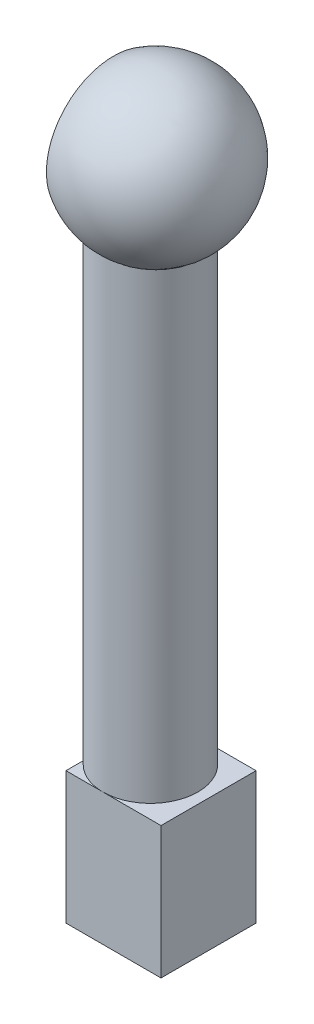
ISO-10303-21;
HEADER;
FILE_DESCRIPTION(('STEP AP214'),'2;1');
FILE_NAME('part.step','',(''),(''),'','','');
FILE_SCHEMA(('AUTOMOTIVE_DESIGN { 1 0 10303 214 1 1 1 1 }'));
ENDSEC;
DATA;
#1=APPLICATION_CONTEXT('core data for automotive mechanical design processes');
#2=APPLICATION_PROTOCOL_DEFINITION('international standard','automotive_design',2000,#1);
#3=PRODUCT_CONTEXT('',#1,'mechanical');
#4=PRODUCT('Part','Part','',(#3));
#5=PRODUCT_RELATED_PRODUCT_CATEGORY('part','',(#4));
#6=PRODUCT_DEFINITION_FORMATION('','',#4);
#7=PRODUCT_DEFINITION_CONTEXT('part definition',#1,'design');
#8=PRODUCT_DEFINITION('design','',#6,#7);
#9=PRODUCT_DEFINITION_SHAPE('','',#8);
#10=(LENGTH_UNIT() NAMED_UNIT(*) SI_UNIT(.MILLI.,.METRE.));
#11=(NAMED_UNIT(*) PLANE_ANGLE_UNIT() SI_UNIT($,.RADIAN.));
#12=(NAMED_UNIT(*) SI_UNIT($,.STERADIAN.) SOLID_ANGLE_UNIT());
#13=UNCERTAINTY_MEASURE_WITH_UNIT(LENGTH_MEASURE(1.E-05),#10,'distance_accuracy_value','');
#14=(GEOMETRIC_REPRESENTATION_CONTEXT(3) GLOBAL_UNCERTAINTY_ASSIGNED_CONTEXT((#13)) GLOBAL_UNIT_ASSIGNED_CONTEXT((#10,
#11,#12)) REPRESENTATION_CONTEXT('',''));
#15=CARTESIAN_POINT('',(0.,0.,0.));
#16=DIRECTION('',(0.,0.,1.));
#17=DIRECTION('',(1.,0.,0.));
#18=AXIS2_PLACEMENT_3D('',#15,#16,#17);
#19=CARTESIAN_POINT('',(8.,112.5,0.));
#20=DIRECTION('',(0.,0.,-1.));
#21=DIRECTION('',(1.,0.,0.));
#22=AXIS2_PLACEMENT_3D('',#19,#20,#21);
#23=SPHERICAL_SURFACE('',#22,15.);
#24=CARTESIAN_POINT('',(-0.0002,101.142200917431,-5.65660675316924));
#25=CARTESIAN_POINT('',(0.159226429552618,101.12816404405,-5.85394456270704));
#26=CARTESIAN_POINT('',(0.327009064397159,101.113417723746,-6.0444719838419));
#27=CARTESIAN_POINT('',(0.677977454781112,101.082636429866,-6.41063237746506));
#28=CARTESIAN_POINT('',(0.861162190433337,101.066601541619,-6.58626633461546));
#29=CARTESIAN_POINT('',(1.24149235089014,101.033384961327,-6.92125642203254));
#30=CARTESIAN_POINT('',(1.43862631093757,101.016204211709,-7.08062566294762));
#31=CARTESIAN_POINT('',(1.84556686784812,100.980822660256,-7.38213631983255));
#32=CARTESIAN_POINT('',(2.05537337482632,100.962621865656,-7.52427785797501));
#33=CARTESIAN_POINT('',(2.48624376051173,100.92533649927,-7.7903881062603));
#34=CARTESIAN_POINT('',(2.70731176733069,100.906251603636,-7.91435008681562));
#35=CARTESIAN_POINT('',(3.1590632082289,100.867351777167,-8.14317599791478));
#36=CARTESIAN_POINT('',(3.38974681279554,100.84753683339,-8.24803958966141));
#37=CARTESIAN_POINT('',(3.85905016057209,100.807331170978,-8.43792030765256));
#38=CARTESIAN_POINT('',(4.09766862461698,100.786940545227,-8.52294061524826));
#39=CARTESIAN_POINT('',(4.58118596544015,100.745732841768,-8.67256494656186));
#40=CARTESIAN_POINT('',(4.82608482674891,100.724915765111,-8.73716902056269));
#41=CARTESIAN_POINT('',(5.3209412507796,100.682964696537,-8.84562348299345));
#42=CARTESIAN_POINT('',(5.57090818690204,100.661830140587,-8.88943088760492));
#43=CARTESIAN_POINT('',(6.0737246805863,100.619431877091,-8.95579944654537));
#44=CARTESIAN_POINT('',(6.32657520735289,100.598168127315,-8.97835323074184));
#45=CARTESIAN_POINT('',(6.83327231077784,100.555670963762,-9.00202896228383));
#46=CARTESIAN_POINT('',(7.0871188562154,100.534437549063,-9.00315157611855));
#47=CARTESIAN_POINT('',(7.5940189555199,100.492149025707,-8.98395634265039));
#48=CARTESIAN_POINT('',(7.84707249690605,100.471093919847,-8.96363815958206));
#49=CARTESIAN_POINT('',(8.35086123291072,100.429285026704,-8.90166585114058));
#50=CARTESIAN_POINT('',(8.60159359644402,100.40853159329,-8.85998846825485));
#51=CARTESIAN_POINT('',(9.09867898244304,100.367490815964,-8.75557234717104));
#52=CARTESIAN_POINT('',(9.34503190377218,100.347203482813,-8.69283312324522));
#53=CARTESIAN_POINT('',(9.83153483959631,100.307237025291,-8.54674798405963));
#54=CARTESIAN_POINT('',(10.0716863601095,100.287557753019,-8.46340712491511));
#55=CARTESIAN_POINT('',(10.5442145427364,100.248926481342,-8.27666023609827));
#56=CARTESIAN_POINT('',(10.7765884882351,100.229974735719,-8.17324727948803));
#57=CARTESIAN_POINT('',(11.2315173493628,100.192954174527,-7.94724405913697));
#58=CARTESIAN_POINT('',(11.4540844114928,100.174884263578,-7.82467842508971));
#59=CARTESIAN_POINT('',(11.888122278083,100.139718701566,-7.56113238127527));
#60=CARTESIAN_POINT('',(12.0995928779538,100.122623068466,-7.42015163214914));
#61=CARTESIAN_POINT('',(12.509910058203,100.089516762802,-7.12077156576664));
#62=CARTESIAN_POINT('',(12.7087567562104,100.073506080128,-6.96237241085207));
#63=CARTESIAN_POINT('',(13.0923974635182,100.042671526991,-6.62927057600549));
#64=CARTESIAN_POINT('',(13.2771911909844,100.02784768033,-6.45456756925404));
#65=CARTESIAN_POINT('',(13.6308988809827,99.9995200937908,-6.09059927601648));
#66=CARTESIAN_POINT('',(13.7998548966575,99.9860128539503,-5.90137512865447));
#67=CARTESIAN_POINT('',(14.1212348580881,99.9603574882847,-5.50928918330946));
#68=CARTESIAN_POINT('',(14.2736589523678,99.9482093502492,-5.30642750787333));
#69=CARTESIAN_POINT('',(14.5608704315419,99.9253480536402,-4.88850937069203));
#70=CARTESIAN_POINT('',(14.6956580921405,99.9146348726345,-4.67345309965594));
#71=CARTESIAN_POINT('',(14.9466207054768,99.8947098125159,-4.23267479172378));
#72=CARTESIAN_POINT('',(15.0627956729911,99.8854979322112,-4.00695276329535));
#73=CARTESIAN_POINT('',(15.2753356971084,99.8686603214552,-3.54721588924438));
#74=CARTESIAN_POINT('',(15.371764841877,99.8610294585804,-3.31323085806842));
#75=CARTESIAN_POINT('',(15.5446241305187,99.8473601558783,-2.83784905866247));
#76=CARTESIAN_POINT('',(15.6210473413017,99.8413222680936,-2.59644975329977));
#77=CARTESIAN_POINT('',(15.7532826186728,99.8308803574823,-2.10808619026538));
#78=CARTESIAN_POINT('',(15.8090986878065,99.8264760173694,-1.86112302316581));
#79=CARTESIAN_POINT('',(15.899735495069,99.8193263668107,-1.36334466676926));
#80=CARTESIAN_POINT('',(15.9345558298835,99.8165810882344,-1.11252940357096));
#81=CARTESIAN_POINT('',(15.9828898202327,99.812770859332,-0.609429282946981));
#82=CARTESIAN_POINT('',(15.996452709601,99.8117020262285,-0.357149183692108));
#83=CARTESIAN_POINT('',(16.0023282586629,99.8112389661835,0.147664920609639));
#84=CARTESIAN_POINT('',(15.9946405096387,99.8118447714505,0.400198930446644));
#85=CARTESIAN_POINT('',(15.9580699230292,99.8147273613757,0.903713689628644));
#86=CARTESIAN_POINT('',(15.9291874336374,99.817004118583,1.15469446442233));
#87=CARTESIAN_POINT('',(15.8504371102387,99.8232147667346,1.65332104101938));
#88=CARTESIAN_POINT('',(15.8005692711634,99.827148658079,1.90096684201725));
#89=CARTESIAN_POINT('',(15.6802462053351,99.8366467740298,2.39101292263306));
#90=CARTESIAN_POINT('',(15.6098035601239,99.8422100022984,2.63341631099039));
#91=CARTESIAN_POINT('',(15.4488299409077,99.8549337556553,3.11140945464511));
#92=CARTESIAN_POINT('',(15.3582993981669,99.8620942464521,3.34699935609757));
#93=CARTESIAN_POINT('',(15.1577999255626,99.8779691484232,3.80970820595454));
#94=CARTESIAN_POINT('',(15.0478305950062,99.8866835916293,4.03682697962626));
#95=CARTESIAN_POINT('',(14.8092485982939,99.9056128877549,4.4809802180876));
#96=CARTESIAN_POINT('',(14.6806362785026,99.9158277127992,4.69801487012933));
#97=CARTESIAN_POINT('',(14.4054899631766,99.9377112048372,5.12078318024648));
#98=CARTESIAN_POINT('',(14.2589301795073,99.9493819642774,5.32649994653511));
#99=CARTESIAN_POINT('',(13.9491431703661,99.9740893005933,5.72477381226249));
#100=CARTESIAN_POINT('',(13.7859216705664,99.9871254083172,5.91733539466292));
#101=CARTESIAN_POINT('',(13.4439040104057,100.014488589305,6.28806146301864));
#102=CARTESIAN_POINT('',(13.2651048140104,100.028815914241,6.46622312938294));
#103=CARTESIAN_POINT('',(12.8932392067962,100.058669638506,6.80685754812857));
#104=CARTESIAN_POINT('',(12.7001730806442,100.07419601391,6.96933061339431));
#105=CARTESIAN_POINT('',(12.3005993674836,100.10639444851,7.27787985095317));
#106=CARTESIAN_POINT('',(12.094056568007,100.123069515953,7.4239101099663));
#107=CARTESIAN_POINT('',(11.669479349465,100.157421110274,7.69803971101369));
#108=CARTESIAN_POINT('',(11.4514450702628,100.175097624963,7.82613927121363));
#109=CARTESIAN_POINT('',(11.0053916296167,100.211342153088,8.06354017909889));
#110=CARTESIAN_POINT('',(10.7773706450926,100.229910329358,8.17283807643098));
#111=CARTESIAN_POINT('',(10.3130781407714,100.267808243242,8.37181471600377));
#112=CARTESIAN_POINT('',(10.0768094673437,100.287137718412,8.46150015059876));
#113=CARTESIAN_POINT('',(9.59682281859466,100.326502792159,8.62094397727154));
#114=CARTESIAN_POINT('',(9.35308274635448,100.34654051901,8.69063532949219));
#115=CARTESIAN_POINT('',(8.86063993222967,100.387127028068,8.8092087037556));
#116=CARTESIAN_POINT('',(8.61193728974007,100.407675800042,8.85809114214176));
#117=CARTESIAN_POINT('',(8.11131843330367,100.449146635848,8.93471297263942));
#118=CARTESIAN_POINT('',(7.85940211297583,100.470068712047,8.96245166298204));
#119=CARTESIAN_POINT('',(7.35415069904265,100.512141813107,8.99659312153944));
#120=CARTESIAN_POINT('',(7.10081562527573,100.53329283477,9.00299618734762));
#121=CARTESIAN_POINT('',(6.59390112987572,100.575728386136,8.99441480740389));
#122=CARTESIAN_POINT('',(6.34032260006244,100.597013115044,8.97937857706341));
#123=CARTESIAN_POINT('',(5.83542444803432,100.639506748483,8.92794118818703));
#124=CARTESIAN_POINT('',(5.58410407815538,100.660715676596,8.89154738719422));
#125=CARTESIAN_POINT('',(5.08534612539792,100.702918257009,8.79764247719859));
#126=CARTESIAN_POINT('',(4.8379096772432,100.723911845795,8.74012531229197));
#127=CARTESIAN_POINT('',(4.34875754326556,100.765523106054,8.60437893412233));
#128=CARTESIAN_POINT('',(4.10704175189491,100.78614078446,8.52615010332048));
#129=CARTESIAN_POINT('',(3.63087696880259,100.826861227704,8.34946360648111));
#130=CARTESIAN_POINT('',(3.39643328249119,100.846963614834,8.25099155361384));
#131=CARTESIAN_POINT('',(2.93667340639718,100.88648471188,8.03454641588384));
#132=CARTESIAN_POINT('',(2.71135707862559,100.90590343213,7.91657362597372));
#133=CARTESIAN_POINT('',(2.27158457975327,100.94389642546,7.66202255265097));
#134=CARTESIAN_POINT('',(2.05712218978345,100.962471181458,7.5254550926388));
#135=CARTESIAN_POINT('',(1.64053864494382,100.998634675315,7.23468744441583));
#136=CARTESIAN_POINT('',(1.43841385488319,101.016223703486,7.0804924888729));
#137=CARTESIAN_POINT('',(1.01574599918162,101.053084044418,6.72875430177732));
#138=CARTESIAN_POINT('',(0.797629081611496,101.072157289855,6.52825075580277));
#139=CARTESIAN_POINT('',(0.486251415125274,101.099448010343,6.21232138761675));
#140=CARTESIAN_POINT('',(0.385154428968884,101.108319541866,6.10456005870645));
#141=CARTESIAN_POINT('',(0.188369931199796,101.125607071583,5.88417431541953));
#142=CARTESIAN_POINT('',(0.0926823429799898,101.134023076227,5.77154996995211));
#143=CARTESIAN_POINT('',(-0.0001999999999992,101.142200917431,5.65660675316926));
#144=B_SPLINE_CURVE_WITH_KNOTS('',3,(#24,#25,#26,#27,#28,#29,#30,#31,#32,#33,#34,#35,#36,#37,
#38,#39,#40,#41,#42,#43,#44,#45,#46,#47,#48,#49,#50,#51,#52,#53,#54,#55,#56,#57,#58,#59,#60,#61,
#62,#63,#64,#65,#66,#67,#68,#69,#70,#71,#72,#73,#74,#75,#76,#77,#78,#79,#80,#81,#82,#83,#84,#85,
#86,#87,#88,#89,#90,#91,#92,#93,#94,#95,#96,#97,#98,#99,#100,#101,#102,#103,#104,#105,#106,#107,
#108,#109,#110,#111,#112,#113,#114,#115,#116,#117,#118,#119,#120,#121,#122,#123,#124,#125,#126,
#127,#128,#129,#130,#131,#132,#133,#134,#135,#136,#137,#138,#139,#140,#141,#142,#143),
.UNSPECIFIED.,.F.,.F.,(4,2,2,2,2,2,2,2,2,2,2,2,2,2,2,2,2,2,2,2,2,2,2,2,2,2,2,2,2,2,2,2,2,2,2,2,
2,2,2,2,2,2,2,2,2,2,2,2,2,2,2,2,2,2,2,2,2,2,2,4),(0.,0.761999554471396,1.52394869098601,
2.28527870285736,3.04660331533682,3.80820904236431,4.56982827863475,5.33132532519173,
6.09282049625144,6.85588279219463,7.61920959850648,8.38251266603559,9.14582768715937,
9.90997563496493,10.674141206745,11.4381194205871,12.2023617557646,12.9656292685623,
13.7289108490549,14.4921853162674,15.2554750870138,16.0166770403088,16.7778721543541,
17.5390553674874,18.3002379763212,19.0589094577888,19.8178435111096,20.5766300782689,
21.3354312207537,22.0924723122449,22.8495279641561,23.6065711792137,24.3636145771143,
25.1201960069686,25.8767611954538,26.6333419808848,27.3899087117443,28.147575573383,
28.9049829394966,29.6625382530883,30.4200784553116,31.1796840627851,31.9392804272126,
32.6990160392323,33.4584920009838,34.2204854826127,34.9824637176085,35.7444672418448,
36.5064601374646,37.27029667564,38.0338702314748,38.7976628690052,39.5614414033409,
40.3257646423508,41.0900763218742,41.8539450053249,42.617587522634,43.5066330870117,
43.9505598753058,44.3944803751974),.UNSPECIFIED.);
#145=CARTESIAN_POINT('',(0.,101.142183308399,-5.65685424949234));
#146=VERTEX_POINT('',#145);
#147=CARTESIAN_POINT('',(0.,101.142183308399,5.65685424949238));
#148=VERTEX_POINT('',#147);
#149=EDGE_CURVE('E47',#146,#148,#144,.T.);
#150=ORIENTED_EDGE('',*,*,#149,.F.);
#151=CARTESIAN_POINT('',(0.,112.5,0.));
#152=DIRECTION('',(-1.,0.,0.));
#153=DIRECTION('',(0.,0.,1.));
#154=AXIS2_PLACEMENT_3D('',#151,#152,#153);
#155=CIRCLE('',#154,12.6885775404495);
#156=EDGE_CURVE('E11',#146,#148,#155,.F.);
#157=ORIENTED_EDGE('',*,*,#156,.T.);
#158=EDGE_LOOP('',(#150,#157));
#159=FACE_BOUND('',#158,.T.);
#160=ADVANCED_FACE('F39',(#159),#23,.T.);
#161=CARTESIAN_POINT('',(18.,12.5,-9.));
#162=DIRECTION('',(0.,-1.,0.));
#163=DIRECTION('',(0.,0.,-1.));
#164=AXIS2_PLACEMENT_3D('',#161,#162,#163);
#165=PLANE('',#164);
#166=CARTESIAN_POINT('',(7.,12.5,0.));
#167=DIRECTION('',(0.,1.,0.));
#168=DIRECTION('',(0.,0.,1.));
#169=AXIS2_PLACEMENT_3D('',#166,#167,#168);
#170=CIRCLE('',#169,9.);
#171=CARTESIAN_POINT('',(0.,12.5,5.65685424949237));
#172=VERTEX_POINT('',#171);
#173=CARTESIAN_POINT('',(7.,12.5,9.));
#174=VERTEX_POINT('',#173);
#175=EDGE_CURVE('E134',#172,#174,#170,.T.);
#176=ORIENTED_EDGE('',*,*,#175,.F.);
#177=DIRECTION('',(0.,0.,1.));
#178=VECTOR('',#177,1.);
#179=CARTESIAN_POINT('',(0.,12.5,-9.));
#180=LINE('',#179,#178);
#181=CARTESIAN_POINT('',(0.,12.5,9.));
#182=VERTEX_POINT('',#181);
#183=EDGE_CURVE('E186',#172,#182,#180,.T.);
#184=ORIENTED_EDGE('',*,*,#183,.T.);
#185=DIRECTION('',(-1.,0.,0.));
#186=VECTOR('',#185,1.);
#187=CARTESIAN_POINT('',(18.,12.5,9.));
#188=LINE('',#187,#186);
#189=EDGE_CURVE('E178',#174,#182,#188,.T.);
#190=ORIENTED_EDGE('',*,*,#189,.F.);
#191=EDGE_LOOP('',(#176,#184,#190));
#192=FACE_BOUND('',#191,.T.);
#193=ADVANCED_FACE('F209',(#192),#165,.F.);
#194=CARTESIAN_POINT('',(7.,12.5,-9.));
#195=VERTEX_POINT('',#194);
#196=EDGE_CURVE('E127',#174,#195,#170,.T.);
#197=ORIENTED_EDGE('',*,*,#196,.F.);
#198=CARTESIAN_POINT('',(18.,12.5,9.));
#199=VERTEX_POINT('',#198);
#200=EDGE_CURVE('E188',#199,#174,#188,.T.);
#201=ORIENTED_EDGE('',*,*,#200,.F.);
#202=DIRECTION('',(0.,0.,1.));
#203=VECTOR('',#202,1.);
#204=CARTESIAN_POINT('',(18.,12.5,-9.));
#205=LINE('',#204,#203);
#206=CARTESIAN_POINT('',(18.,12.5,-9.));
#207=VERTEX_POINT('',#206);
#208=EDGE_CURVE('E176',#207,#199,#205,.T.);
#209=ORIENTED_EDGE('',*,*,#208,.F.);
#210=DIRECTION('',(-1.,0.,0.));
#211=VECTOR('',#210,1.);
#212=CARTESIAN_POINT('',(18.,12.5,-9.));
#213=LINE('',#212,#211);
#214=EDGE_CURVE('E192',#207,#195,#213,.T.);
#215=ORIENTED_EDGE('',*,*,#214,.T.);
#216=EDGE_LOOP('',(#197,#201,#209,#215));
#217=FACE_BOUND('',#216,.T.);
#218=ADVANCED_FACE('F215',(#217),#165,.F.);
#219=CARTESIAN_POINT('',(18.,-12.5,9.));
#220=DIRECTION('',(0.,0.,-1.));
#221=DIRECTION('',(-1.,0.,0.));
#222=AXIS2_PLACEMENT_3D('',#219,#220,#221);
#223=PLANE('',#222);
#224=DIRECTION('',(0.,-1.,0.));
#225=VECTOR('',#224,1.);
#226=CARTESIAN_POINT('',(0.,-12.5,9.));
#227=LINE('',#226,#225);
#228=CARTESIAN_POINT('',(0.,-12.5,9.));
#229=VERTEX_POINT('',#228);
#230=EDGE_CURVE('E161',#182,#229,#227,.T.);
#231=ORIENTED_EDGE('',*,*,#230,.T.);
#232=DIRECTION('',(-1.,0.,0.));
#233=VECTOR('',#232,1.);
#234=CARTESIAN_POINT('',(18.,-12.5,9.));
#235=LINE('',#234,#233);
#236=CARTESIAN_POINT('',(18.,-12.5,9.));
#237=VERTEX_POINT('',#236);
#238=EDGE_CURVE('E198',#237,#229,#235,.T.);
#239=ORIENTED_EDGE('',*,*,#238,.F.);
#240=DIRECTION('',(0.,-1.,0.));
#241=VECTOR('',#240,1.);
#242=CARTESIAN_POINT('',(18.,-12.5,9.));
#243=LINE('',#242,#241);
#244=EDGE_CURVE('E168',#199,#237,#243,.T.);
#245=ORIENTED_EDGE('',*,*,#244,.F.);
#246=ORIENTED_EDGE('',*,*,#200,.T.);
#247=ORIENTED_EDGE('',*,*,#189,.T.);
#248=EDGE_LOOP('',(#231,#239,#245,#246,#247));
#249=FACE_BOUND('',#248,.T.);
#250=ADVANCED_FACE('F41',(#249),#223,.F.);
#251=CARTESIAN_POINT('',(18.,-12.5,-9.));
#252=DIRECTION('',(0.,1.,0.));
#253=DIRECTION('',(0.,0.,1.));
#254=AXIS2_PLACEMENT_3D('',#251,#252,#253);
#255=PLANE('',#254);
#256=DIRECTION('',(-1.,0.,0.));
#257=VECTOR('',#256,1.);
#258=CARTESIAN_POINT('',(8.5,-12.5,6.2));
#259=LINE('',#258,#257);
#260=CARTESIAN_POINT('',(15.5,-12.5,6.2));
#261=VERTEX_POINT('',#260);
#262=CARTESIAN_POINT('',(8.5,-12.5,6.2));
#263=VERTEX_POINT('',#262);
#264=EDGE_CURVE('E132',#261,#263,#259,.T.);
#265=ORIENTED_EDGE('',*,*,#264,.F.);
#266=DIRECTION('',(0.,0.,1.));
#267=VECTOR('',#266,1.);
#268=CARTESIAN_POINT('',(15.5,-12.5,-6.2));
#269=LINE('',#268,#267);
#270=CARTESIAN_POINT('',(15.5,-12.5,-6.2));
#271=VERTEX_POINT('',#270);
#272=EDGE_CURVE('E130',#271,#261,#269,.T.);
#273=ORIENTED_EDGE('',*,*,#272,.F.);
#274=DIRECTION('',(1.,0.,0.));
#275=VECTOR('',#274,1.);
#276=CARTESIAN_POINT('',(8.5,-12.5,-6.2));
#277=LINE('',#276,#275);
#278=CARTESIAN_POINT('',(8.5,-12.5,-6.2));
#279=VERTEX_POINT('',#278);
#280=EDGE_CURVE('E142',#279,#271,#277,.T.);
#281=ORIENTED_EDGE('',*,*,#280,.F.);
#282=DIRECTION('',(0.,0.,-1.));
#283=VECTOR('',#282,1.);
#284=CARTESIAN_POINT('',(8.5,-12.5,-6.2));
#285=LINE('',#284,#283);
#286=EDGE_CURVE('E154',#263,#279,#285,.T.);
#287=ORIENTED_EDGE('',*,*,#286,.F.);
#288=EDGE_LOOP('',(#265,#273,#281,#287));
#289=FACE_BOUND('',#288,.T.);
#290=DIRECTION('',(0.,0.,-1.));
#291=VECTOR('',#290,1.);
#292=CARTESIAN_POINT('',(0.,-12.5,-9.));
#293=LINE('',#292,#291);
#294=CARTESIAN_POINT('',(0.,-12.5,-9.));
#295=VERTEX_POINT('',#294);
#296=EDGE_CURVE('E181',#229,#295,#293,.T.);
#297=ORIENTED_EDGE('',*,*,#296,.T.);
#298=DIRECTION('',(-1.,0.,0.));
#299=VECTOR('',#298,1.);
#300=CARTESIAN_POINT('',(18.,-12.5,-9.));
#301=LINE('',#300,#299);
#302=CARTESIAN_POINT('',(18.,-12.5,-9.));
#303=VERTEX_POINT('',#302);
#304=EDGE_CURVE('E195',#303,#295,#301,.T.);
#305=ORIENTED_EDGE('',*,*,#304,.F.);
#306=DIRECTION('',(0.,0.,-1.));
#307=VECTOR('',#306,1.);
#308=CARTESIAN_POINT('',(18.,-12.5,-9.));
#309=LINE('',#308,#307);
#310=EDGE_CURVE('E171',#237,#303,#309,.T.);
#311=ORIENTED_EDGE('',*,*,#310,.F.);
#312=ORIENTED_EDGE('',*,*,#238,.T.);
#313=EDGE_LOOP('',(#297,#305,#311,#312));
#314=FACE_BOUND('',#313,.T.);
#315=ADVANCED_FACE('F236',(#289,#314),#255,.F.);
#316=CARTESIAN_POINT('',(18.,-12.5,-9.));
#317=DIRECTION('',(0.,0.,1.));
#318=DIRECTION('',(1.,0.,0.));
#319=AXIS2_PLACEMENT_3D('',#316,#317,#318);
#320=PLANE('',#319);
#321=DIRECTION('',(0.,1.,0.));
#322=VECTOR('',#321,1.);
#323=CARTESIAN_POINT('',(0.,-12.5,-9.));
#324=LINE('',#323,#322);
#325=CARTESIAN_POINT('',(0.,12.5,-9.));
#326=VERTEX_POINT('',#325);
#327=EDGE_CURVE('E183',#295,#326,#324,.T.);
#328=ORIENTED_EDGE('',*,*,#327,.T.);
#329=EDGE_CURVE('E191',#195,#326,#213,.T.);
#330=ORIENTED_EDGE('',*,*,#329,.F.);
#331=ORIENTED_EDGE('',*,*,#214,.F.);
#332=DIRECTION('',(0.,1.,0.));
#333=VECTOR('',#332,1.);
#334=CARTESIAN_POINT('',(18.,-12.5,-9.));
#335=LINE('',#334,#333);
#336=EDGE_CURVE('E174',#303,#207,#335,.T.);
#337=ORIENTED_EDGE('',*,*,#336,.F.);
#338=ORIENTED_EDGE('',*,*,#304,.T.);
#339=EDGE_LOOP('',(#328,#330,#331,#337,#338));
#340=FACE_BOUND('',#339,.T.);
#341=ADVANCED_FACE('F228',(#340),#320,.F.);
#342=CARTESIAN_POINT('',(0.,12.5,-5.65685424949237));
#343=VERTEX_POINT('',#342);
#344=EDGE_CURVE('E59',#195,#343,#170,.T.);
#345=ORIENTED_EDGE('',*,*,#344,.F.);
#346=ORIENTED_EDGE('',*,*,#329,.T.);
#347=EDGE_CURVE('E172',#326,#343,#180,.T.);
#348=ORIENTED_EDGE('',*,*,#347,.T.);
#349=EDGE_LOOP('',(#345,#346,#348));
#350=FACE_BOUND('',#349,.T.);
#351=ADVANCED_FACE('F218',(#350),#165,.F.);
#352=CARTESIAN_POINT('',(18.,0.,0.));
#353=DIRECTION('',(1.,0.,0.));
#354=DIRECTION('',(0.,0.,-1.));
#355=AXIS2_PLACEMENT_3D('',#352,#353,#354);
#356=PLANE('',#355);
#357=ORIENTED_EDGE('',*,*,#244,.T.);
#358=ORIENTED_EDGE('',*,*,#310,.T.);
#359=ORIENTED_EDGE('',*,*,#336,.T.);
#360=ORIENTED_EDGE('',*,*,#208,.T.);
#361=EDGE_LOOP('',(#357,#358,#359,#360));
#362=FACE_BOUND('',#361,.T.);
#363=ADVANCED_FACE('F227',(#362),#356,.T.);
#364=CARTESIAN_POINT('',(0.,0.,0.));
#365=DIRECTION('',(1.,0.,0.));
#366=DIRECTION('',(0.,0.,-1.));
#367=AXIS2_PLACEMENT_3D('',#364,#365,#366);
#368=PLANE('',#367);
#369=DIRECTION('',(0.,-1.,0.));
#370=VECTOR('',#369,1.);
#371=CARTESIAN_POINT('',(0.,112.5,5.65685424949238));
#372=LINE('',#371,#370);
#373=EDGE_CURVE('E125',#148,#172,#372,.T.);
#374=ORIENTED_EDGE('',*,*,#373,.F.);
#375=ORIENTED_EDGE('',*,*,#156,.F.);
#376=DIRECTION('',(0.,-1.,0.));
#377=VECTOR('',#376,1.);
#378=CARTESIAN_POINT('',(0.,112.5,-5.65685424949236));
#379=LINE('',#378,#377);
#380=EDGE_CURVE('E123',#146,#343,#379,.T.);
#381=ORIENTED_EDGE('',*,*,#380,.T.);
#382=ORIENTED_EDGE('',*,*,#347,.F.);
#383=ORIENTED_EDGE('',*,*,#327,.F.);
#384=ORIENTED_EDGE('',*,*,#296,.F.);
#385=ORIENTED_EDGE('',*,*,#230,.F.);
#386=ORIENTED_EDGE('',*,*,#183,.F.);
#387=EDGE_LOOP('',(#374,#375,#381,#382,#383,#384,#385,#386));
#388=FACE_BOUND('',#387,.T.);
#389=ADVANCED_FACE('F120',(#388),#368,.F.);
#390=CARTESIAN_POINT('',(15.5,7.5,-6.2));
#391=DIRECTION('',(1.,0.,0.));
#392=DIRECTION('',(0.,0.,-1.));
#393=AXIS2_PLACEMENT_3D('',#390,#391,#392);
#394=PLANE('',#393);
#395=ORIENTED_EDGE('',*,*,#272,.T.);
#396=DIRECTION('',(0.,-1.,0.));
#397=VECTOR('',#396,1.);
#398=CARTESIAN_POINT('',(15.5,7.5,6.2));
#399=LINE('',#398,#397);
#400=CARTESIAN_POINT('',(15.5,7.5,6.2));
#401=VERTEX_POINT('',#400);
#402=EDGE_CURVE('E150',#401,#261,#399,.T.);
#403=ORIENTED_EDGE('',*,*,#402,.F.);
#404=DIRECTION('',(0.,0.,1.));
#405=VECTOR('',#404,1.);
#406=CARTESIAN_POINT('',(15.5,7.5,-6.2));
#407=LINE('',#406,#405);
#408=CARTESIAN_POINT('',(15.5,7.5,-6.2));
#409=VERTEX_POINT('',#408);
#410=EDGE_CURVE('E138',#409,#401,#407,.T.);
#411=ORIENTED_EDGE('',*,*,#410,.F.);
#412=DIRECTION('',(0.,-1.,0.));
#413=VECTOR('',#412,1.);
#414=CARTESIAN_POINT('',(15.5,7.5,-6.2));
#415=LINE('',#414,#413);
#416=EDGE_CURVE('E159',#409,#271,#415,.T.);
#417=ORIENTED_EDGE('',*,*,#416,.T.);
#418=EDGE_LOOP('',(#395,#403,#411,#417));
#419=FACE_BOUND('',#418,.T.);
#420=ADVANCED_FACE('F283',(#419),#394,.F.);
#421=CARTESIAN_POINT('',(8.5,7.5,-6.2));
#422=DIRECTION('',(0.,0.,-1.));
#423=DIRECTION('',(-1.,0.,0.));
#424=AXIS2_PLACEMENT_3D('',#421,#422,#423);
#425=PLANE('',#424);
#426=ORIENTED_EDGE('',*,*,#280,.T.);
#427=ORIENTED_EDGE('',*,*,#416,.F.);
#428=DIRECTION('',(1.,0.,0.));
#429=VECTOR('',#428,1.);
#430=CARTESIAN_POINT('',(8.5,7.5,-6.2));
#431=LINE('',#430,#429);
#432=CARTESIAN_POINT('',(8.5,7.5,-6.2));
#433=VERTEX_POINT('',#432);
#434=EDGE_CURVE('E148',#433,#409,#431,.T.);
#435=ORIENTED_EDGE('',*,*,#434,.F.);
#436=DIRECTION('',(0.,-1.,0.));
#437=VECTOR('',#436,1.);
#438=CARTESIAN_POINT('',(8.5,7.5,-6.2));
#439=LINE('',#438,#437);
#440=EDGE_CURVE('E162',#433,#279,#439,.T.);
#441=ORIENTED_EDGE('',*,*,#440,.T.);
#442=EDGE_LOOP('',(#426,#427,#435,#441));
#443=FACE_BOUND('',#442,.T.);
#444=ADVANCED_FACE('F311',(#443),#425,.F.);
#445=CARTESIAN_POINT('',(8.5,7.5,-6.2));
#446=DIRECTION('',(-1.,0.,0.));
#447=DIRECTION('',(0.,0.,1.));
#448=AXIS2_PLACEMENT_3D('',#445,#446,#447);
#449=PLANE('',#448);
#450=ORIENTED_EDGE('',*,*,#286,.T.);
#451=ORIENTED_EDGE('',*,*,#440,.F.);
#452=DIRECTION('',(0.,0.,-1.));
#453=VECTOR('',#452,1.);
#454=CARTESIAN_POINT('',(8.5,7.5,-6.2));
#455=LINE('',#454,#453);
#456=CARTESIAN_POINT('',(8.5,7.5,6.2));
#457=VERTEX_POINT('',#456);
#458=EDGE_CURVE('E145',#457,#433,#455,.T.);
#459=ORIENTED_EDGE('',*,*,#458,.F.);
#460=DIRECTION('',(0.,-1.,0.));
#461=VECTOR('',#460,1.);
#462=CARTESIAN_POINT('',(8.5,7.5,6.2));
#463=LINE('',#462,#461);
#464=EDGE_CURVE('E164',#457,#263,#463,.T.);
#465=ORIENTED_EDGE('',*,*,#464,.T.);
#466=EDGE_LOOP('',(#450,#451,#459,#465));
#467=FACE_BOUND('',#466,.T.);
#468=ADVANCED_FACE('F307',(#467),#449,.F.);
#469=CARTESIAN_POINT('',(8.5,7.5,6.2));
#470=DIRECTION('',(0.,0.,1.));
#471=DIRECTION('',(1.,0.,0.));
#472=AXIS2_PLACEMENT_3D('',#469,#470,#471);
#473=PLANE('',#472);
#474=ORIENTED_EDGE('',*,*,#264,.T.);
#475=ORIENTED_EDGE('',*,*,#464,.F.);
#476=DIRECTION('',(-1.,0.,0.));
#477=VECTOR('',#476,1.);
#478=CARTESIAN_POINT('',(8.5,7.5,6.2));
#479=LINE('',#478,#477);
#480=EDGE_CURVE('E141',#401,#457,#479,.T.);
#481=ORIENTED_EDGE('',*,*,#480,.F.);
#482=ORIENTED_EDGE('',*,*,#402,.T.);
#483=EDGE_LOOP('',(#474,#475,#481,#482));
#484=FACE_BOUND('',#483,.T.);
#485=ADVANCED_FACE('F303',(#484),#473,.F.);
#486=CARTESIAN_POINT('',(0.,7.5,0.));
#487=DIRECTION('',(0.,1.,0.));
#488=DIRECTION('',(0.,0.,1.));
#489=AXIS2_PLACEMENT_3D('',#486,#487,#488);
#490=PLANE('',#489);
#491=ORIENTED_EDGE('',*,*,#410,.T.);
#492=ORIENTED_EDGE('',*,*,#480,.T.);
#493=ORIENTED_EDGE('',*,*,#458,.T.);
#494=ORIENTED_EDGE('',*,*,#434,.T.);
#495=EDGE_LOOP('',(#491,#492,#493,#494));
#496=FACE_BOUND('',#495,.T.);
#497=ADVANCED_FACE('F270',(#496),#490,.F.);
#498=CARTESIAN_POINT('',(7.,112.5,0.));
#499=DIRECTION('',(0.,-1.,0.));
#500=DIRECTION('',(0.,0.,-1.));
#501=AXIS2_PLACEMENT_3D('',#498,#499,#500);
#502=CYLINDRICAL_SURFACE('',#501,9.);
#503=ORIENTED_EDGE('',*,*,#380,.F.);
#504=ORIENTED_EDGE('',*,*,#149,.T.);
#505=ORIENTED_EDGE('',*,*,#373,.T.);
#506=ORIENTED_EDGE('',*,*,#175,.T.);
#507=ORIENTED_EDGE('',*,*,#196,.T.);
#508=ORIENTED_EDGE('',*,*,#344,.T.);
#509=EDGE_LOOP('',(#503,#504,#505,#506,#507,#508));
#510=FACE_BOUND('',#509,.T.);
#511=ADVANCED_FACE('F128',(#510),#502,.T.);
#512=CLOSED_SHELL('',(#160,#193,#218,#250,#315,#341,#351,#363,#389,#420,#444,#468,#485,#497,#511));
#513=MANIFOLD_SOLID_BREP('B2',#512);
#514=ADVANCED_BREP_SHAPE_REPRESENTATION('',(#18,#513),#14);
#515=SHAPE_DEFINITION_REPRESENTATION(#9,#514);
ENDSEC;
END-ISO-10303-21;
